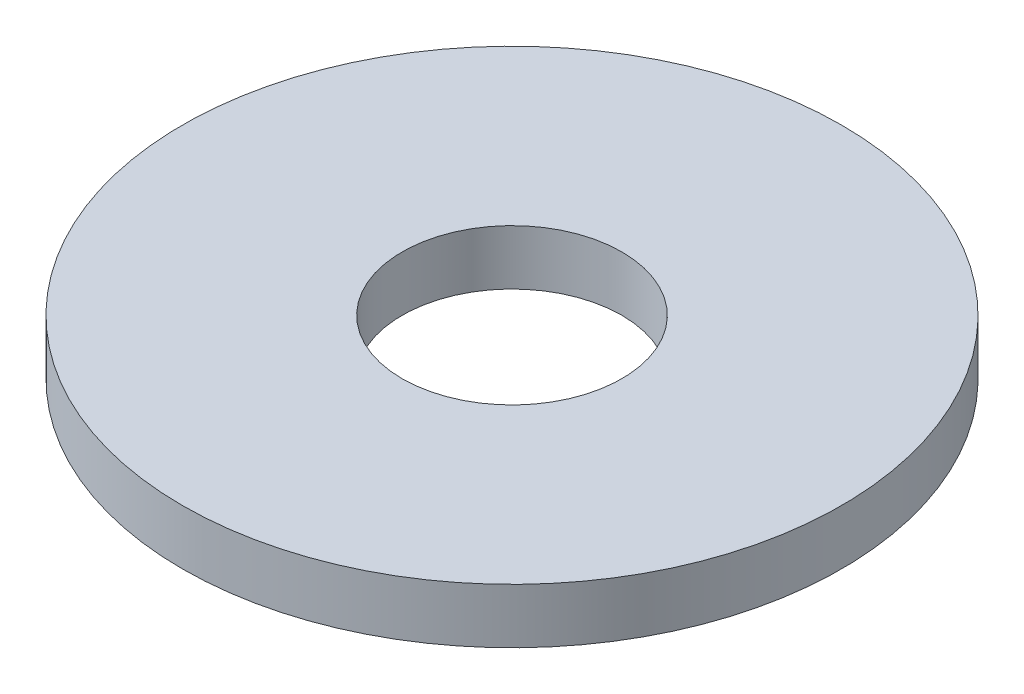
ISO-10303-21;
HEADER;
FILE_DESCRIPTION(('STEP AP214'),'2;1');
FILE_NAME('part.step','',(''),(''),'','','');
FILE_SCHEMA(('AUTOMOTIVE_DESIGN { 1 0 10303 214 1 1 1 1 }'));
ENDSEC;
DATA;
#1=APPLICATION_CONTEXT('core data for automotive mechanical design processes');
#2=APPLICATION_PROTOCOL_DEFINITION('international standard','automotive_design',2000,#1);
#3=PRODUCT_CONTEXT('',#1,'mechanical');
#4=PRODUCT('Part','Part','',(#3));
#5=PRODUCT_RELATED_PRODUCT_CATEGORY('part','',(#4));
#6=PRODUCT_DEFINITION_FORMATION('','',#4);
#7=PRODUCT_DEFINITION_CONTEXT('part definition',#1,'design');
#8=PRODUCT_DEFINITION('design','',#6,#7);
#9=PRODUCT_DEFINITION_SHAPE('','',#8);
#10=(LENGTH_UNIT() NAMED_UNIT(*) SI_UNIT(.MILLI.,.METRE.));
#11=(NAMED_UNIT(*) PLANE_ANGLE_UNIT() SI_UNIT($,.RADIAN.));
#12=(NAMED_UNIT(*) SI_UNIT($,.STERADIAN.) SOLID_ANGLE_UNIT());
#13=UNCERTAINTY_MEASURE_WITH_UNIT(LENGTH_MEASURE(1.E-05),#10,'distance_accuracy_value','');
#14=(GEOMETRIC_REPRESENTATION_CONTEXT(3) GLOBAL_UNCERTAINTY_ASSIGNED_CONTEXT((#13)) GLOBAL_UNIT_ASSIGNED_CONTEXT((#10,
#11,#12)) REPRESENTATION_CONTEXT('',''));
#15=CARTESIAN_POINT('',(0.,0.,0.));
#16=DIRECTION('',(0.,0.,1.));
#17=DIRECTION('',(1.,0.,0.));
#18=AXIS2_PLACEMENT_3D('',#15,#16,#17);
#19=CARTESIAN_POINT('',(0.,0.,0.));
#20=DIRECTION('',(0.,-1.,0.));
#21=DIRECTION('',(0.,0.,-1.));
#22=AXIS2_PLACEMENT_3D('',#19,#20,#21);
#23=CYLINDRICAL_SURFACE('',#22,10.);
#24=CARTESIAN_POINT('',(0.,12.472196922487,0.));
#25=DIRECTION('',(0.,-1.,0.));
#26=DIRECTION('',(0.,0.,-1.));
#27=AXIS2_PLACEMENT_3D('',#24,#25,#26);
#28=CIRCLE('',#27,10.);
#29=CARTESIAN_POINT('',(0.,12.472196922487,-10.));
#30=VERTEX_POINT('',#29);
#31=EDGE_CURVE('E10',#30,#30,#28,.T.);
#32=ORIENTED_EDGE('',*,*,#31,.F.);
#33=EDGE_LOOP('',(#32));
#34=FACE_BOUND('',#33,.T.);
#35=CARTESIAN_POINT('',(0.,7.47219692248696,0.));
#36=DIRECTION('',(0.,-1.,0.));
#37=DIRECTION('',(0.,0.,-1.));
#38=AXIS2_PLACEMENT_3D('',#35,#36,#37);
#39=CIRCLE('',#38,10.);
#40=CARTESIAN_POINT('',(0.,7.47219692248696,-10.));
#41=VERTEX_POINT('',#40);
#42=EDGE_CURVE('E46',#41,#41,#39,.T.);
#43=ORIENTED_EDGE('',*,*,#42,.T.);
#44=EDGE_LOOP('',(#43));
#45=FACE_BOUND('',#44,.T.);
#46=ADVANCED_FACE('F32',(#34,#45),#23,.F.);
#47=CARTESIAN_POINT('',(-10.,12.472196922487,0.));
#48=DIRECTION('',(0.,-1.,0.));
#49=DIRECTION('',(0.,0.,-1.));
#50=AXIS2_PLACEMENT_3D('',#47,#48,#49);
#51=PLANE('',#50);
#52=CARTESIAN_POINT('',(0.,12.472196922487,0.));
#53=DIRECTION('',(0.,-1.,0.));
#54=DIRECTION('',(0.,0.,-1.));
#55=AXIS2_PLACEMENT_3D('',#52,#53,#54);
#56=CIRCLE('',#55,30.);
#57=CARTESIAN_POINT('',(0.,12.472196922487,-30.));
#58=VERTEX_POINT('',#57);
#59=EDGE_CURVE('E38',#58,#58,#56,.T.);
#60=ORIENTED_EDGE('',*,*,#59,.F.);
#61=EDGE_LOOP('',(#60));
#62=FACE_BOUND('',#61,.T.);
#63=ORIENTED_EDGE('',*,*,#31,.T.);
#64=EDGE_LOOP('',(#63));
#65=FACE_BOUND('',#64,.T.);
#66=ADVANCED_FACE('F61',(#62,#65),#51,.F.);
#67=CARTESIAN_POINT('',(0.,0.,0.));
#68=DIRECTION('',(0.,-1.,0.));
#69=DIRECTION('',(0.,0.,-1.));
#70=AXIS2_PLACEMENT_3D('',#67,#68,#69);
#71=CYLINDRICAL_SURFACE('',#70,30.);
#72=CARTESIAN_POINT('',(0.,7.47219692248696,0.));
#73=DIRECTION('',(0.,-1.,0.));
#74=DIRECTION('',(0.,0.,-1.));
#75=AXIS2_PLACEMENT_3D('',#72,#73,#74);
#76=CIRCLE('',#75,30.);
#77=CARTESIAN_POINT('',(0.,7.47219692248696,-30.));
#78=VERTEX_POINT('',#77);
#79=EDGE_CURVE('E42',#78,#78,#76,.T.);
#80=ORIENTED_EDGE('',*,*,#79,.F.);
#81=EDGE_LOOP('',(#80));
#82=FACE_BOUND('',#81,.T.);
#83=ORIENTED_EDGE('',*,*,#59,.T.);
#84=EDGE_LOOP('',(#83));
#85=FACE_BOUND('',#84,.T.);
#86=ADVANCED_FACE('F56',(#82,#85),#71,.T.);
#87=CARTESIAN_POINT('',(-10.,7.47219692248696,0.));
#88=DIRECTION('',(0.,1.,0.));
#89=DIRECTION('',(0.,0.,1.));
#90=AXIS2_PLACEMENT_3D('',#87,#88,#89);
#91=PLANE('',#90);
#92=ORIENTED_EDGE('',*,*,#42,.F.);
#93=EDGE_LOOP('',(#92));
#94=FACE_BOUND('',#93,.T.);
#95=ORIENTED_EDGE('',*,*,#79,.T.);
#96=EDGE_LOOP('',(#95));
#97=FACE_BOUND('',#96,.T.);
#98=ADVANCED_FACE('F53',(#94,#97),#91,.F.);
#99=CLOSED_SHELL('',(#46,#66,#86,#98));
#100=MANIFOLD_SOLID_BREP('B2',#99);
#101=ADVANCED_BREP_SHAPE_REPRESENTATION('',(#18,#100),#14);
#102=SHAPE_DEFINITION_REPRESENTATION(#9,#101);
ENDSEC;
END-ISO-10303-21;
